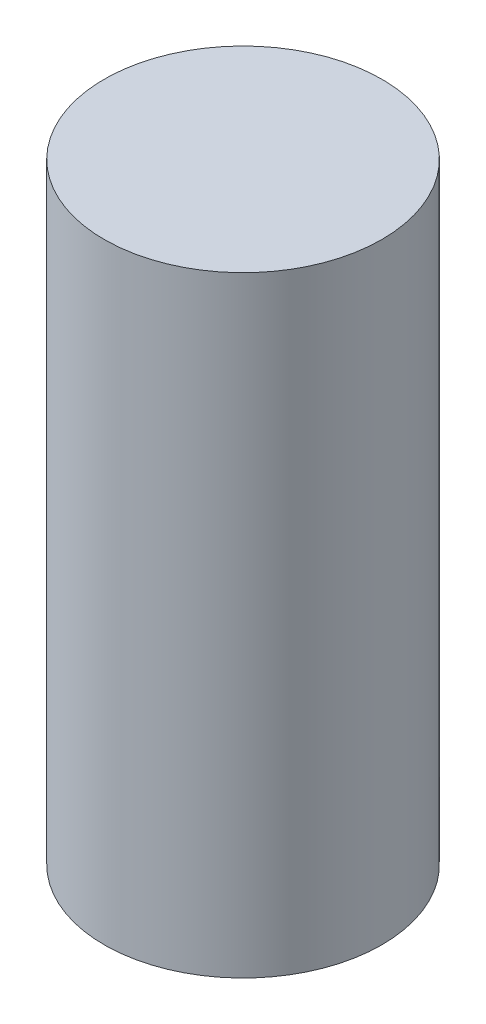
ISO-10303-21;
HEADER;
FILE_DESCRIPTION(('STEP AP214'),'2;1');
FILE_NAME('part.step','',(''),(''),'','','');
FILE_SCHEMA(('AUTOMOTIVE_DESIGN { 1 0 10303 214 1 1 1 1 }'));
ENDSEC;
DATA;
#1=APPLICATION_CONTEXT('core data for automotive mechanical design processes');
#2=APPLICATION_PROTOCOL_DEFINITION('international standard','automotive_design',2000,#1);
#3=PRODUCT_CONTEXT('',#1,'mechanical');
#4=PRODUCT('Part','Part','',(#3));
#5=PRODUCT_RELATED_PRODUCT_CATEGORY('part','',(#4));
#6=PRODUCT_DEFINITION_FORMATION('','',#4);
#7=PRODUCT_DEFINITION_CONTEXT('part definition',#1,'design');
#8=PRODUCT_DEFINITION('design','',#6,#7);
#9=PRODUCT_DEFINITION_SHAPE('','',#8);
#10=(LENGTH_UNIT() NAMED_UNIT(*) SI_UNIT(.MILLI.,.METRE.));
#11=(NAMED_UNIT(*) PLANE_ANGLE_UNIT() SI_UNIT($,.RADIAN.));
#12=(NAMED_UNIT(*) SI_UNIT($,.STERADIAN.) SOLID_ANGLE_UNIT());
#13=UNCERTAINTY_MEASURE_WITH_UNIT(LENGTH_MEASURE(1.E-05),#10,'distance_accuracy_value','');
#14=(GEOMETRIC_REPRESENTATION_CONTEXT(3) GLOBAL_UNCERTAINTY_ASSIGNED_CONTEXT((#13)) GLOBAL_UNIT_ASSIGNED_CONTEXT((#10,
#11,#12)) REPRESENTATION_CONTEXT('',''));
#15=CARTESIAN_POINT('',(0.,0.,0.));
#16=DIRECTION('',(0.,0.,1.));
#17=DIRECTION('',(1.,0.,0.));
#18=AXIS2_PLACEMENT_3D('',#15,#16,#17);
#19=CARTESIAN_POINT('',(0.,18.161,0.));
#20=DIRECTION('',(0.,-1.,0.));
#21=DIRECTION('',(1.,0.,0.));
#22=AXIS2_PLACEMENT_3D('',#19,#20,#21);
#23=CYLINDRICAL_SURFACE('',#22,8.25500000000001);
#24=CARTESIAN_POINT('',(0.,-18.161,0.));
#25=DIRECTION('',(0.,-1.,0.));
#26=DIRECTION('',(1.,0.,0.));
#27=AXIS2_PLACEMENT_3D('',#24,#25,#26);
#28=CIRCLE('',#27,8.25500000000001);
#29=CARTESIAN_POINT('',(8.25500000000002,-18.161,0.));
#30=VERTEX_POINT('',#29);
#31=EDGE_CURVE('E10',#30,#30,#28,.T.);
#32=ORIENTED_EDGE('',*,*,#31,.F.);
#33=EDGE_LOOP('',(#32));
#34=FACE_BOUND('',#33,.T.);
#35=CARTESIAN_POINT('',(0.,18.161,0.));
#36=DIRECTION('',(0.,-1.,0.));
#37=DIRECTION('',(1.,0.,0.));
#38=AXIS2_PLACEMENT_3D('',#35,#36,#37);
#39=CIRCLE('',#38,8.255);
#40=CARTESIAN_POINT('',(8.255,18.161,0.));
#41=VERTEX_POINT('',#40);
#42=EDGE_CURVE('E39',#41,#41,#39,.T.);
#43=ORIENTED_EDGE('',*,*,#42,.T.);
#44=EDGE_LOOP('',(#43));
#45=FACE_BOUND('',#44,.T.);
#46=ADVANCED_FACE('F33',(#34,#45),#23,.T.);
#47=CARTESIAN_POINT('',(-8.255,-18.161,0.));
#48=DIRECTION('',(0.,1.,0.));
#49=DIRECTION('',(-1.,0.,0.));
#50=AXIS2_PLACEMENT_3D('',#47,#48,#49);
#51=PLANE('',#50);
#52=ORIENTED_EDGE('',*,*,#31,.T.);
#53=EDGE_LOOP('',(#52));
#54=FACE_BOUND('',#53,.T.);
#55=ADVANCED_FACE('F48',(#54),#51,.F.);
#56=CARTESIAN_POINT('',(-8.255,18.161,0.));
#57=DIRECTION('',(0.,-1.,0.));
#58=DIRECTION('',(1.,0.,0.));
#59=AXIS2_PLACEMENT_3D('',#56,#57,#58);
#60=PLANE('',#59);
#61=ORIENTED_EDGE('',*,*,#42,.F.);
#62=EDGE_LOOP('',(#61));
#63=FACE_BOUND('',#62,.T.);
#64=ADVANCED_FACE('F46',(#63),#60,.F.);
#65=CLOSED_SHELL('',(#46,#55,#64));
#66=MANIFOLD_SOLID_BREP('B2',#65);
#67=ADVANCED_BREP_SHAPE_REPRESENTATION('',(#18,#66),#14);
#68=SHAPE_DEFINITION_REPRESENTATION(#9,#67);
ENDSEC;
END-ISO-10303-21;
